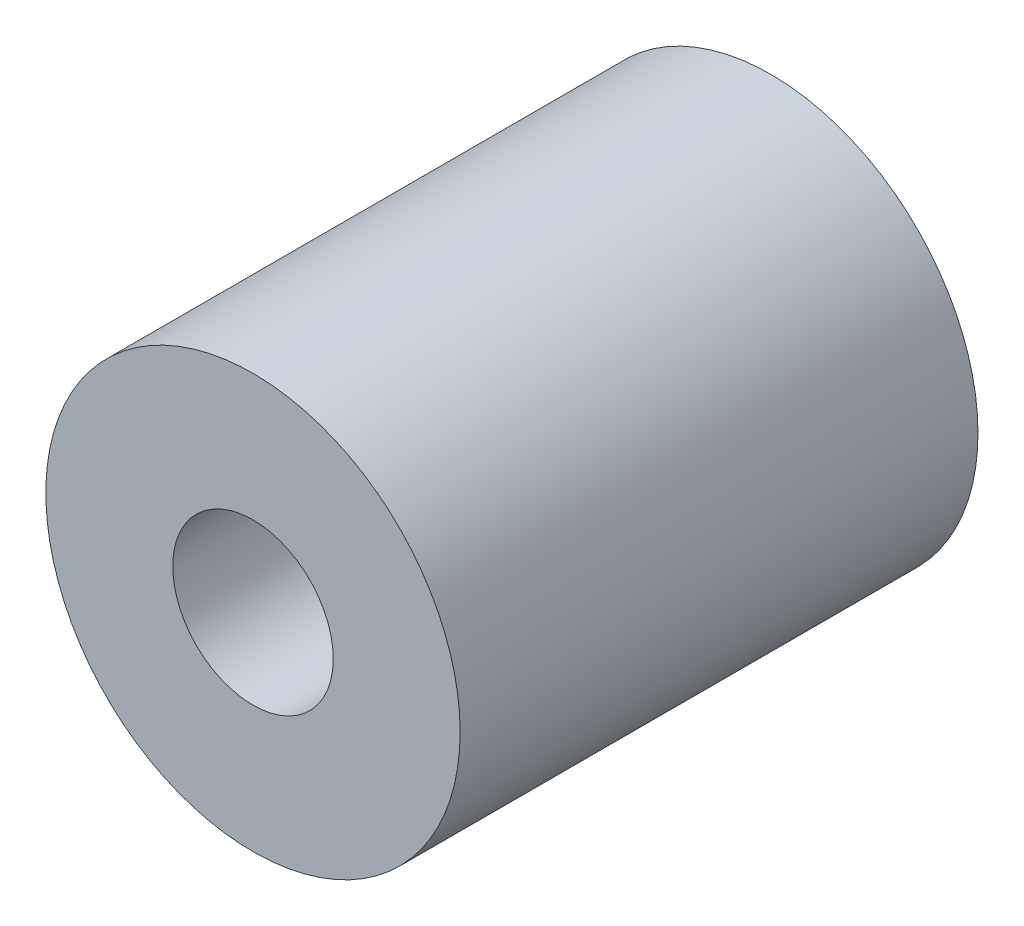
ISO-10303-21;
HEADER;
FILE_DESCRIPTION(('STEP AP214'),'2;1');
FILE_NAME('part.step','',(''),(''),'','','');
FILE_SCHEMA(('AUTOMOTIVE_DESIGN { 1 0 10303 214 1 1 1 1 }'));
ENDSEC;
DATA;
#1=APPLICATION_CONTEXT('core data for automotive mechanical design processes');
#2=APPLICATION_PROTOCOL_DEFINITION('international standard','automotive_design',2000,#1);
#3=PRODUCT_CONTEXT('',#1,'mechanical');
#4=PRODUCT('Part','Part','',(#3));
#5=PRODUCT_RELATED_PRODUCT_CATEGORY('part','',(#4));
#6=PRODUCT_DEFINITION_FORMATION('','',#4);
#7=PRODUCT_DEFINITION_CONTEXT('part definition',#1,'design');
#8=PRODUCT_DEFINITION('design','',#6,#7);
#9=PRODUCT_DEFINITION_SHAPE('','',#8);
#10=(LENGTH_UNIT() NAMED_UNIT(*) SI_UNIT(.MILLI.,.METRE.));
#11=(NAMED_UNIT(*) PLANE_ANGLE_UNIT() SI_UNIT($,.RADIAN.));
#12=(NAMED_UNIT(*) SI_UNIT($,.STERADIAN.) SOLID_ANGLE_UNIT());
#13=UNCERTAINTY_MEASURE_WITH_UNIT(LENGTH_MEASURE(1.E-05),#10,'distance_accuracy_value','');
#14=(GEOMETRIC_REPRESENTATION_CONTEXT(3) GLOBAL_UNCERTAINTY_ASSIGNED_CONTEXT((#13)) GLOBAL_UNIT_ASSIGNED_CONTEXT((#10,
#11,#12)) REPRESENTATION_CONTEXT('',''));
#15=CARTESIAN_POINT('',(0.,0.,0.));
#16=DIRECTION('',(0.,0.,1.));
#17=DIRECTION('',(1.,0.,0.));
#18=AXIS2_PLACEMENT_3D('',#15,#16,#17);
#19=CARTESIAN_POINT('',(0.,0.,10.));
#20=DIRECTION('',(0.,0.,1.));
#21=DIRECTION('',(1.,0.,0.));
#22=AXIS2_PLACEMENT_3D('',#19,#20,#21);
#23=PLANE('',#22);
#24=CARTESIAN_POINT('',(0.,0.,10.));
#25=DIRECTION('',(0.,0.,1.));
#26=DIRECTION('',(1.,0.,0.));
#27=AXIS2_PLACEMENT_3D('',#24,#25,#26);
#28=CIRCLE('',#27,8.);
#29=CARTESIAN_POINT('',(8.,0.,10.));
#30=VERTEX_POINT('',#29);
#31=EDGE_CURVE('E10',#30,#30,#28,.T.);
#32=ORIENTED_EDGE('',*,*,#31,.T.);
#33=EDGE_LOOP('',(#32));
#34=FACE_BOUND('',#33,.T.);
#35=CARTESIAN_POINT('',(0.,0.,10.));
#36=DIRECTION('',(0.,0.,1.));
#37=DIRECTION('',(1.,0.,0.));
#38=AXIS2_PLACEMENT_3D('',#35,#36,#37);
#39=CIRCLE('',#38,3.1);
#40=CARTESIAN_POINT('',(3.1,0.,10.));
#41=VERTEX_POINT('',#40);
#42=EDGE_CURVE('E43',#41,#41,#39,.T.);
#43=ORIENTED_EDGE('',*,*,#42,.F.);
#44=EDGE_LOOP('',(#43));
#45=FACE_BOUND('',#44,.T.);
#46=ADVANCED_FACE('F32',(#34,#45),#23,.T.);
#47=CARTESIAN_POINT('',(0.,0.,-10.));
#48=DIRECTION('',(0.,0.,1.));
#49=DIRECTION('',(1.,0.,0.));
#50=AXIS2_PLACEMENT_3D('',#47,#48,#49);
#51=PLANE('',#50);
#52=CARTESIAN_POINT('',(0.,0.,-10.));
#53=DIRECTION('',(0.,0.,1.));
#54=DIRECTION('',(1.,0.,0.));
#55=AXIS2_PLACEMENT_3D('',#52,#53,#54);
#56=CIRCLE('',#55,8.);
#57=CARTESIAN_POINT('',(8.,0.,-10.));
#58=VERTEX_POINT('',#57);
#59=EDGE_CURVE('E36',#58,#58,#56,.T.);
#60=ORIENTED_EDGE('',*,*,#59,.F.);
#61=EDGE_LOOP('',(#60));
#62=FACE_BOUND('',#61,.T.);
#63=CARTESIAN_POINT('',(0.,0.,-10.));
#64=DIRECTION('',(0.,0.,1.));
#65=DIRECTION('',(1.,0.,0.));
#66=AXIS2_PLACEMENT_3D('',#63,#64,#65);
#67=CIRCLE('',#66,3.1);
#68=CARTESIAN_POINT('',(3.1,0.,-10.));
#69=VERTEX_POINT('',#68);
#70=EDGE_CURVE('E45',#69,#69,#67,.T.);
#71=ORIENTED_EDGE('',*,*,#70,.T.);
#72=EDGE_LOOP('',(#71));
#73=FACE_BOUND('',#72,.T.);
#74=ADVANCED_FACE('F55',(#62,#73),#51,.F.);
#75=CARTESIAN_POINT('',(0.,0.,10.));
#76=DIRECTION('',(0.,0.,-1.));
#77=DIRECTION('',(-1.,0.,0.));
#78=AXIS2_PLACEMENT_3D('',#75,#76,#77);
#79=CYLINDRICAL_SURFACE('',#78,8.);
#80=ORIENTED_EDGE('',*,*,#31,.F.);
#81=EDGE_LOOP('',(#80));
#82=FACE_BOUND('',#81,.T.);
#83=ORIENTED_EDGE('',*,*,#59,.T.);
#84=EDGE_LOOP('',(#83));
#85=FACE_BOUND('',#84,.T.);
#86=ADVANCED_FACE('F34',(#82,#85),#79,.T.);
#87=CARTESIAN_POINT('',(0.,0.,10.));
#88=DIRECTION('',(0.,0.,-1.));
#89=DIRECTION('',(-1.,0.,0.));
#90=AXIS2_PLACEMENT_3D('',#87,#88,#89);
#91=CYLINDRICAL_SURFACE('',#90,3.1);
#92=ORIENTED_EDGE('',*,*,#42,.T.);
#93=EDGE_LOOP('',(#92));
#94=FACE_BOUND('',#93,.T.);
#95=ORIENTED_EDGE('',*,*,#70,.F.);
#96=EDGE_LOOP('',(#95));
#97=FACE_BOUND('',#96,.T.);
#98=ADVANCED_FACE('F51',(#94,#97),#91,.F.);
#99=CLOSED_SHELL('',(#46,#74,#86,#98));
#100=MANIFOLD_SOLID_BREP('B2',#99);
#101=ADVANCED_BREP_SHAPE_REPRESENTATION('',(#18,#100),#14);
#102=SHAPE_DEFINITION_REPRESENTATION(#9,#101);
ENDSEC;
END-ISO-10303-21;
